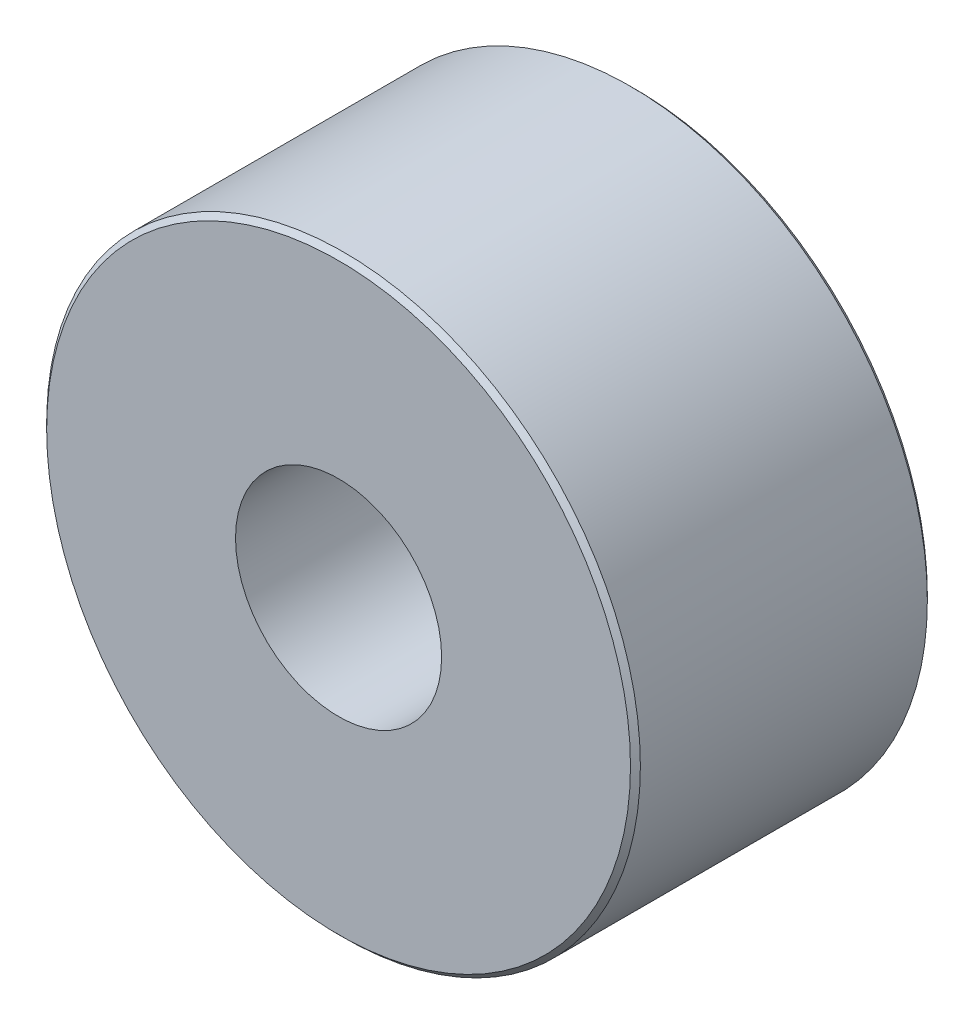
ISO-10303-21;
HEADER;
FILE_DESCRIPTION(('STEP AP214'),'2;1');
FILE_NAME('part.step','',(''),(''),'','','');
FILE_SCHEMA(('AUTOMOTIVE_DESIGN { 1 0 10303 214 1 1 1 1 }'));
ENDSEC;
DATA;
#1=APPLICATION_CONTEXT('core data for automotive mechanical design processes');
#2=APPLICATION_PROTOCOL_DEFINITION('international standard','automotive_design',2000,#1);
#3=PRODUCT_CONTEXT('',#1,'mechanical');
#4=PRODUCT('Part','Part','',(#3));
#5=PRODUCT_RELATED_PRODUCT_CATEGORY('part','',(#4));
#6=PRODUCT_DEFINITION_FORMATION('','',#4);
#7=PRODUCT_DEFINITION_CONTEXT('part definition',#1,'design');
#8=PRODUCT_DEFINITION('design','',#6,#7);
#9=PRODUCT_DEFINITION_SHAPE('','',#8);
#10=(LENGTH_UNIT() NAMED_UNIT(*) SI_UNIT(.MILLI.,.METRE.));
#11=(NAMED_UNIT(*) PLANE_ANGLE_UNIT() SI_UNIT($,.RADIAN.));
#12=(NAMED_UNIT(*) SI_UNIT($,.STERADIAN.) SOLID_ANGLE_UNIT());
#13=UNCERTAINTY_MEASURE_WITH_UNIT(LENGTH_MEASURE(1.E-05),#10,'distance_accuracy_value','');
#14=(GEOMETRIC_REPRESENTATION_CONTEXT(3) GLOBAL_UNCERTAINTY_ASSIGNED_CONTEXT((#13)) GLOBAL_UNIT_ASSIGNED_CONTEXT((#10,
#11,#12)) REPRESENTATION_CONTEXT('',''));
#15=CARTESIAN_POINT('',(0.,0.,0.));
#16=DIRECTION('',(0.,0.,1.));
#17=DIRECTION('',(1.,0.,0.));
#18=AXIS2_PLACEMENT_3D('',#15,#16,#17);
#19=CARTESIAN_POINT('',(0.,0.,6.));
#20=DIRECTION('',(0.,0.,-1.));
#21=DIRECTION('',(-1.,0.,0.));
#22=AXIS2_PLACEMENT_3D('',#19,#20,#21);
#23=CYLINDRICAL_SURFACE('',#22,6.);
#24=CARTESIAN_POINT('',(0.,0.,0.0999999999999985));
#25=DIRECTION('',(0.,0.,1.));
#26=DIRECTION('',(1.,0.,0.));
#27=AXIS2_PLACEMENT_3D('',#24,#25,#26);
#28=CIRCLE('',#27,6.);
#29=CARTESIAN_POINT('',(6.,0.,0.0999999999999985));
#30=VERTEX_POINT('',#29);
#31=EDGE_CURVE('E41',#30,#30,#28,.T.);
#32=ORIENTED_EDGE('',*,*,#31,.T.);
#33=EDGE_LOOP('',(#32));
#34=FACE_BOUND('',#33,.T.);
#35=CARTESIAN_POINT('',(0.,0.,5.9));
#36=DIRECTION('',(0.,0.,1.));
#37=DIRECTION('',(1.,0.,0.));
#38=AXIS2_PLACEMENT_3D('',#35,#36,#37);
#39=CIRCLE('',#38,6.);
#40=CARTESIAN_POINT('',(6.,0.,5.9));
#41=VERTEX_POINT('',#40);
#42=EDGE_CURVE('E45',#41,#41,#39,.F.);
#43=ORIENTED_EDGE('',*,*,#42,.T.);
#44=EDGE_LOOP('',(#43));
#45=FACE_BOUND('',#44,.T.);
#46=ADVANCED_FACE('F30',(#34,#45),#23,.T.);
#47=CARTESIAN_POINT('',(0.,0.,6.));
#48=DIRECTION('',(0.,0.,1.));
#49=DIRECTION('',(1.,0.,0.));
#50=AXIS2_PLACEMENT_3D('',#47,#48,#49);
#51=PLANE('',#50);
#52=CARTESIAN_POINT('',(0.,0.,6.));
#53=DIRECTION('',(0.,0.,1.));
#54=DIRECTION('',(1.,0.,0.));
#55=AXIS2_PLACEMENT_3D('',#52,#53,#54);
#56=CIRCLE('',#55,5.9);
#57=CARTESIAN_POINT('',(5.9,0.,6.));
#58=VERTEX_POINT('',#57);
#59=EDGE_CURVE('E10',#58,#58,#56,.T.);
#60=ORIENTED_EDGE('',*,*,#59,.T.);
#61=EDGE_LOOP('',(#60));
#62=FACE_BOUND('',#61,.T.);
#63=CARTESIAN_POINT('',(0.,0.,6.));
#64=DIRECTION('',(0.,0.,1.));
#65=DIRECTION('',(1.,0.,0.));
#66=AXIS2_PLACEMENT_3D('',#63,#64,#65);
#67=CIRCLE('',#66,2.0828);
#68=CARTESIAN_POINT('',(2.0828,0.,6.));
#69=VERTEX_POINT('',#68);
#70=EDGE_CURVE('E62',#69,#69,#67,.T.);
#71=ORIENTED_EDGE('',*,*,#70,.F.);
#72=EDGE_LOOP('',(#71));
#73=FACE_BOUND('',#72,.T.);
#74=ADVANCED_FACE('F68',(#62,#73),#51,.T.);
#75=CARTESIAN_POINT('',(0.,0.,0.));
#76=DIRECTION('',(0.,0.,1.));
#77=DIRECTION('',(1.,0.,0.));
#78=AXIS2_PLACEMENT_3D('',#75,#76,#77);
#79=PLANE('',#78);
#80=CARTESIAN_POINT('',(0.,0.,0.));
#81=DIRECTION('',(0.,0.,1.));
#82=DIRECTION('',(1.,0.,0.));
#83=AXIS2_PLACEMENT_3D('',#80,#81,#82);
#84=CIRCLE('',#83,5.9);
#85=CARTESIAN_POINT('',(5.9,0.,0.));
#86=VERTEX_POINT('',#85);
#87=EDGE_CURVE('E37',#86,#86,#84,.F.);
#88=ORIENTED_EDGE('',*,*,#87,.T.);
#89=EDGE_LOOP('',(#88));
#90=FACE_BOUND('',#89,.T.);
#91=CARTESIAN_POINT('',(0.,0.,0.));
#92=DIRECTION('',(0.,0.,1.));
#93=DIRECTION('',(1.,0.,0.));
#94=AXIS2_PLACEMENT_3D('',#91,#92,#93);
#95=CIRCLE('',#94,0.229348465884535);
#96=CARTESIAN_POINT('',(0.229348465884535,0.,0.));
#97=VERTEX_POINT('',#96);
#98=EDGE_CURVE('E50',#97,#97,#95,.T.);
#99=ORIENTED_EDGE('',*,*,#98,.T.);
#100=EDGE_LOOP('',(#99));
#101=FACE_BOUND('',#100,.T.);
#102=ADVANCED_FACE('F70',(#90,#101),#79,.F.);
#103=CARTESIAN_POINT('',(0.,0.,0.900000000000001));
#104=DIRECTION('',(0.,0.,1.));
#105=DIRECTION('',(1.,0.,0.));
#106=AXIS2_PLACEMENT_3D('',#103,#104,#105);
#107=CONICAL_SURFACE('',#106,1.7272,1.02974425867665);
#108=CARTESIAN_POINT('',(0.,0.,0.900000000000001));
#109=DIRECTION('',(0.,0.,1.));
#110=DIRECTION('',(1.,0.,0.));
#111=AXIS2_PLACEMENT_3D('',#108,#109,#110);
#112=CIRCLE('',#111,1.7272);
#113=CARTESIAN_POINT('',(1.7272,0.,0.900000000000001));
#114=VERTEX_POINT('',#113);
#115=EDGE_CURVE('E53',#114,#114,#112,.T.);
#116=ORIENTED_EDGE('',*,*,#115,.T.);
#117=EDGE_LOOP('',(#116));
#118=FACE_BOUND('',#117,.T.);
#119=ORIENTED_EDGE('',*,*,#98,.F.);
#120=EDGE_LOOP('',(#119));
#121=FACE_BOUND('',#120,.T.);
#122=ADVANCED_FACE('F76',(#118,#121),#107,.F.);
#123=CARTESIAN_POINT('',(0.,0.,6.));
#124=DIRECTION('',(0.,0.,1.));
#125=DIRECTION('',(1.,0.,0.));
#126=AXIS2_PLACEMENT_3D('',#123,#124,#125);
#127=CYLINDRICAL_SURFACE('',#126,1.7272);
#128=ORIENTED_EDGE('',*,*,#115,.F.);
#129=EDGE_LOOP('',(#128));
#130=FACE_BOUND('',#129,.T.);
#131=CARTESIAN_POINT('',(0.,0.,1.8));
#132=DIRECTION('',(0.,0.,1.));
#133=DIRECTION('',(1.,0.,0.));
#134=AXIS2_PLACEMENT_3D('',#131,#132,#133);
#135=CIRCLE('',#134,1.7272);
#136=CARTESIAN_POINT('',(1.7272,0.,1.8));
#137=VERTEX_POINT('',#136);
#138=EDGE_CURVE('E56',#137,#137,#135,.T.);
#139=ORIENTED_EDGE('',*,*,#138,.T.);
#140=EDGE_LOOP('',(#139));
#141=FACE_BOUND('',#140,.T.);
#142=ADVANCED_FACE('F101',(#130,#141),#127,.F.);
#143=CARTESIAN_POINT('',(1.7272,0.,1.8));
#144=DIRECTION('',(0.,0.,-1.));
#145=DIRECTION('',(-1.,0.,0.));
#146=AXIS2_PLACEMENT_3D('',#143,#144,#145);
#147=PLANE('',#146);
#148=ORIENTED_EDGE('',*,*,#138,.F.);
#149=EDGE_LOOP('',(#148));
#150=FACE_BOUND('',#149,.T.);
#151=CARTESIAN_POINT('',(0.,0.,1.8));
#152=DIRECTION('',(0.,0.,1.));
#153=DIRECTION('',(1.,0.,0.));
#154=AXIS2_PLACEMENT_3D('',#151,#152,#153);
#155=CIRCLE('',#154,2.0828);
#156=CARTESIAN_POINT('',(2.0828,0.,1.8));
#157=VERTEX_POINT('',#156);
#158=EDGE_CURVE('E59',#157,#157,#155,.T.);
#159=ORIENTED_EDGE('',*,*,#158,.T.);
#160=EDGE_LOOP('',(#159));
#161=FACE_BOUND('',#160,.T.);
#162=ADVANCED_FACE('F90',(#150,#161),#147,.F.);
#163=CARTESIAN_POINT('',(0.,0.,6.));
#164=DIRECTION('',(0.,0.,1.));
#165=DIRECTION('',(1.,0.,0.));
#166=AXIS2_PLACEMENT_3D('',#163,#164,#165);
#167=CYLINDRICAL_SURFACE('',#166,2.0828);
#168=ORIENTED_EDGE('',*,*,#158,.F.);
#169=EDGE_LOOP('',(#168));
#170=FACE_BOUND('',#169,.T.);
#171=ORIENTED_EDGE('',*,*,#70,.T.);
#172=EDGE_LOOP('',(#171));
#173=FACE_BOUND('',#172,.T.);
#174=ADVANCED_FACE('F66',(#170,#173),#167,.F.);
#175=CARTESIAN_POINT('',(0.,0.,0.0999999999999985));
#176=DIRECTION('',(0.,0.,1.));
#177=DIRECTION('',(1.,0.,0.));
#178=AXIS2_PLACEMENT_3D('',#175,#176,#177);
#179=CONICAL_SURFACE('',#178,6.,0.785398163397448);
#180=ORIENTED_EDGE('',*,*,#87,.F.);
#181=EDGE_LOOP('',(#180));
#182=FACE_BOUND('',#181,.T.);
#183=ORIENTED_EDGE('',*,*,#31,.F.);
#184=EDGE_LOOP('',(#183));
#185=FACE_BOUND('',#184,.T.);
#186=ADVANCED_FACE('F82',(#182,#185),#179,.T.);
#187=CARTESIAN_POINT('',(0.,0.,6.));
#188=DIRECTION('',(0.,0.,-1.));
#189=DIRECTION('',(-1.,0.,0.));
#190=AXIS2_PLACEMENT_3D('',#187,#188,#189);
#191=CONICAL_SURFACE('',#190,5.9,0.785398163397448);
#192=ORIENTED_EDGE('',*,*,#42,.F.);
#193=EDGE_LOOP('',(#192));
#194=FACE_BOUND('',#193,.T.);
#195=ORIENTED_EDGE('',*,*,#59,.F.);
#196=EDGE_LOOP('',(#195));
#197=FACE_BOUND('',#196,.T.);
#198=ADVANCED_FACE('F32',(#194,#197),#191,.T.);
#199=CLOSED_SHELL('',(#46,#74,#102,#122,#142,#162,#174,#186,#198));
#200=MANIFOLD_SOLID_BREP('B2',#199);
#201=ADVANCED_BREP_SHAPE_REPRESENTATION('',(#18,#200),#14);
#202=SHAPE_DEFINITION_REPRESENTATION(#9,#201);
ENDSEC;
END-ISO-10303-21;
